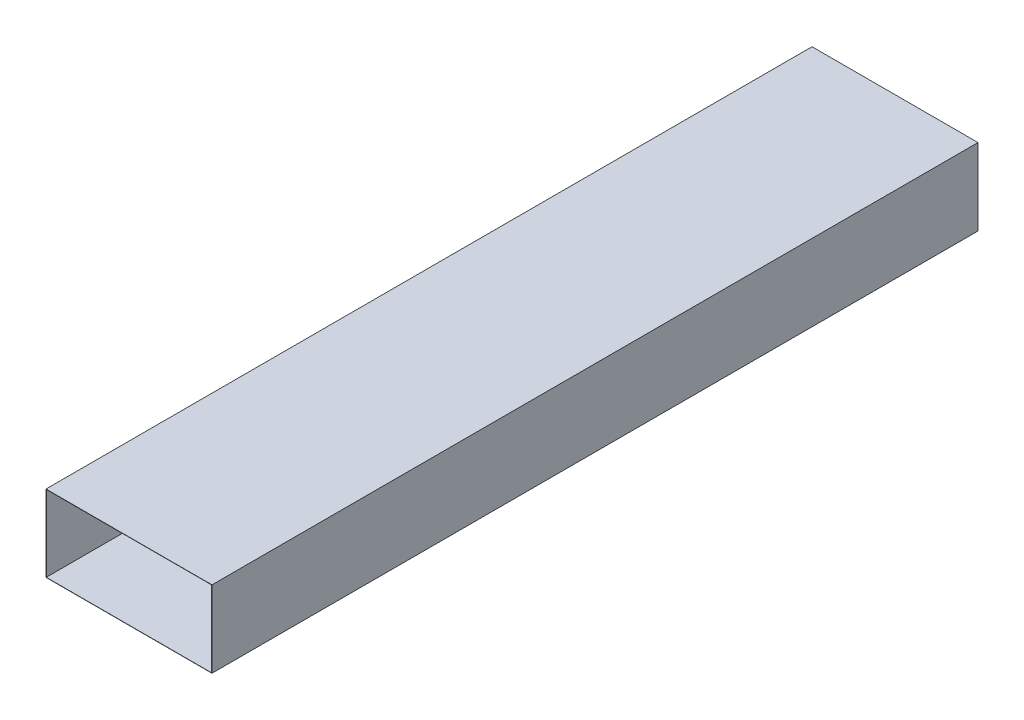
ISO-10303-21;
HEADER;
FILE_DESCRIPTION(('STEP AP214'),'2;1');
FILE_NAME('part.step','',(''),(''),'','','');
FILE_SCHEMA(('AUTOMOTIVE_DESIGN { 1 0 10303 214 1 1 1 1 }'));
ENDSEC;
DATA;
#1=APPLICATION_CONTEXT('core data for automotive mechanical design processes');
#2=APPLICATION_PROTOCOL_DEFINITION('international standard','automotive_design',2000,#1);
#3=PRODUCT_CONTEXT('',#1,'mechanical');
#4=PRODUCT('Part','Part','',(#3));
#5=PRODUCT_RELATED_PRODUCT_CATEGORY('part','',(#4));
#6=PRODUCT_DEFINITION_FORMATION('','',#4);
#7=PRODUCT_DEFINITION_CONTEXT('part definition',#1,'design');
#8=PRODUCT_DEFINITION('design','',#6,#7);
#9=PRODUCT_DEFINITION_SHAPE('','',#8);
#10=(LENGTH_UNIT() NAMED_UNIT(*) SI_UNIT(.MILLI.,.METRE.));
#11=(NAMED_UNIT(*) PLANE_ANGLE_UNIT() SI_UNIT($,.RADIAN.));
#12=(NAMED_UNIT(*) SI_UNIT($,.STERADIAN.) SOLID_ANGLE_UNIT());
#13=UNCERTAINTY_MEASURE_WITH_UNIT(LENGTH_MEASURE(1.E-05),#10,'distance_accuracy_value','');
#14=(GEOMETRIC_REPRESENTATION_CONTEXT(3) GLOBAL_UNCERTAINTY_ASSIGNED_CONTEXT((#13)) GLOBAL_UNIT_ASSIGNED_CONTEXT((#10,
#11,#12)) REPRESENTATION_CONTEXT('',''));
#15=CARTESIAN_POINT('',(0.,0.,0.));
#16=DIRECTION('',(0.,0.,1.));
#17=DIRECTION('',(1.,0.,0.));
#18=AXIS2_PLACEMENT_3D('',#15,#16,#17);
#19=CARTESIAN_POINT('',(-650.,300.,3000.));
#20=DIRECTION('',(0.,1.,0.));
#21=DIRECTION('',(-1.,0.,0.));
#22=AXIS2_PLACEMENT_3D('',#19,#20,#21);
#23=PLANE('',#22);
#24=DIRECTION('',(1.,0.,0.));
#25=VECTOR('',#24,1.);
#26=CARTESIAN_POINT('',(-650.,300.,0.));
#27=LINE('',#26,#25);
#28=CARTESIAN_POINT('',(-650.,300.,0.));
#29=VERTEX_POINT('',#28);
#30=CARTESIAN_POINT('',(0.,300.,0.));
#31=VERTEX_POINT('',#30);
#32=EDGE_CURVE('E152',#29,#31,#27,.T.);
#33=ORIENTED_EDGE('',*,*,#32,.F.);
#34=DIRECTION('',(0.,0.,-1.));
#35=VECTOR('',#34,1.);
#36=CARTESIAN_POINT('',(-650.,300.,3000.));
#37=LINE('',#36,#35);
#38=CARTESIAN_POINT('',(-650.,300.,3000.));
#39=VERTEX_POINT('',#38);
#40=EDGE_CURVE('E12',#39,#29,#37,.T.);
#41=ORIENTED_EDGE('',*,*,#40,.F.);
#42=DIRECTION('',(1.,0.,0.));
#43=VECTOR('',#42,1.);
#44=CARTESIAN_POINT('',(-650.,300.,3000.));
#45=LINE('',#44,#43);
#46=CARTESIAN_POINT('',(0.,300.,3000.));
#47=VERTEX_POINT('',#46);
#48=EDGE_CURVE('E156',#39,#47,#45,.T.);
#49=ORIENTED_EDGE('',*,*,#48,.T.);
#50=DIRECTION('',(0.,0.,-1.));
#51=VECTOR('',#50,1.);
#52=CARTESIAN_POINT('',(0.,300.,3000.));
#53=LINE('',#52,#51);
#54=EDGE_CURVE('E59',#47,#31,#53,.T.);
#55=ORIENTED_EDGE('',*,*,#54,.T.);
#56=EDGE_LOOP('',(#33,#41,#49,#55));
#57=FACE_BOUND('',#56,.T.);
#58=ADVANCED_FACE('F56',(#57),#23,.T.);
#59=CARTESIAN_POINT('',(-650.,300.,3000.));
#60=DIRECTION('',(1.,0.,0.));
#61=DIRECTION('',(0.,0.,-1.));
#62=AXIS2_PLACEMENT_3D('',#59,#60,#61);
#63=PLANE('',#62);
#64=DIRECTION('',(0.,-1.,0.));
#65=VECTOR('',#64,1.);
#66=CARTESIAN_POINT('',(-650.,300.,0.));
#67=LINE('',#66,#65);
#68=CARTESIAN_POINT('',(-650.,0.,0.));
#69=VERTEX_POINT('',#68);
#70=EDGE_CURVE('E160',#29,#69,#67,.T.);
#71=ORIENTED_EDGE('',*,*,#70,.T.);
#72=DIRECTION('',(0.,0.,-1.));
#73=VECTOR('',#72,1.);
#74=CARTESIAN_POINT('',(-650.,0.,3000.));
#75=LINE('',#74,#73);
#76=CARTESIAN_POINT('',(-650.,0.,3000.));
#77=VERTEX_POINT('',#76);
#78=EDGE_CURVE('E64',#77,#69,#75,.T.);
#79=ORIENTED_EDGE('',*,*,#78,.F.);
#80=DIRECTION('',(0.,-1.,0.));
#81=VECTOR('',#80,1.);
#82=CARTESIAN_POINT('',(-650.,300.,3000.));
#83=LINE('',#82,#81);
#84=EDGE_CURVE('E165',#39,#77,#83,.T.);
#85=ORIENTED_EDGE('',*,*,#84,.F.);
#86=ORIENTED_EDGE('',*,*,#40,.T.);
#87=EDGE_LOOP('',(#71,#79,#85,#86));
#88=FACE_BOUND('',#87,.T.);
#89=ADVANCED_FACE('F192',(#88),#63,.F.);
#90=CARTESIAN_POINT('',(-650.,0.,3000.));
#91=DIRECTION('',(0.,1.,0.));
#92=DIRECTION('',(0.,0.,1.));
#93=AXIS2_PLACEMENT_3D('',#90,#91,#92);
#94=PLANE('',#93);
#95=DIRECTION('',(1.,0.,0.));
#96=VECTOR('',#95,1.);
#97=CARTESIAN_POINT('',(-650.,0.,0.));
#98=LINE('',#97,#96);
#99=CARTESIAN_POINT('',(0.,0.,0.));
#100=VERTEX_POINT('',#99);
#101=EDGE_CURVE('E172',#69,#100,#98,.T.);
#102=ORIENTED_EDGE('',*,*,#101,.T.);
#103=DIRECTION('',(0.,0.,-1.));
#104=VECTOR('',#103,1.);
#105=CARTESIAN_POINT('',(0.,0.,3000.));
#106=LINE('',#105,#104);
#107=CARTESIAN_POINT('',(0.,0.,3000.));
#108=VERTEX_POINT('',#107);
#109=EDGE_CURVE('E177',#108,#100,#106,.T.);
#110=ORIENTED_EDGE('',*,*,#109,.F.);
#111=DIRECTION('',(1.,0.,0.));
#112=VECTOR('',#111,1.);
#113=CARTESIAN_POINT('',(-650.,0.,3000.));
#114=LINE('',#113,#112);
#115=EDGE_CURVE('E163',#77,#108,#114,.T.);
#116=ORIENTED_EDGE('',*,*,#115,.F.);
#117=ORIENTED_EDGE('',*,*,#78,.T.);
#118=EDGE_LOOP('',(#102,#110,#116,#117));
#119=FACE_BOUND('',#118,.T.);
#120=ADVANCED_FACE('F196',(#119),#94,.F.);
#121=CARTESIAN_POINT('',(0.,300.,3000.));
#122=DIRECTION('',(1.,0.,0.));
#123=DIRECTION('',(0.,1.,0.));
#124=AXIS2_PLACEMENT_3D('',#121,#122,#123);
#125=PLANE('',#124);
#126=DIRECTION('',(0.,-1.,0.));
#127=VECTOR('',#126,1.);
#128=CARTESIAN_POINT('',(0.,300.,0.));
#129=LINE('',#128,#127);
#130=EDGE_CURVE('E169',#31,#100,#129,.T.);
#131=ORIENTED_EDGE('',*,*,#130,.F.);
#132=ORIENTED_EDGE('',*,*,#54,.F.);
#133=DIRECTION('',(0.,-1.,0.));
#134=VECTOR('',#133,1.);
#135=CARTESIAN_POINT('',(0.,300.,3000.));
#136=LINE('',#135,#134);
#137=EDGE_CURVE('E159',#47,#108,#136,.T.);
#138=ORIENTED_EDGE('',*,*,#137,.T.);
#139=ORIENTED_EDGE('',*,*,#109,.T.);
#140=EDGE_LOOP('',(#131,#132,#138,#139));
#141=FACE_BOUND('',#140,.T.);
#142=ADVANCED_FACE('F185',(#141),#125,.T.);
#143=CARTESIAN_POINT('',(0.,0.,3000.));
#144=DIRECTION('',(0.,0.,-1.));
#145=DIRECTION('',(-1.,0.,0.));
#146=AXIS2_PLACEMENT_3D('',#143,#144,#145);
#147=PLANE('',#146);
#148=DIRECTION('',(0.,-1.,0.));
#149=VECTOR('',#148,1.);
#150=CARTESIAN_POINT('',(-649.,0.,3000.));
#151=LINE('',#150,#149);
#152=CARTESIAN_POINT('',(-649.,299.,3000.));
#153=VERTEX_POINT('',#152);
#154=CARTESIAN_POINT('',(-649.,1.,3000.));
#155=VERTEX_POINT('',#154);
#156=EDGE_CURVE('E126',#153,#155,#151,.T.);
#157=ORIENTED_EDGE('',*,*,#156,.F.);
#158=DIRECTION('',(1.,0.,0.));
#159=VECTOR('',#158,1.);
#160=CARTESIAN_POINT('',(0.,299.,3000.));
#161=LINE('',#160,#159);
#162=CARTESIAN_POINT('',(-1.00000000000003,299.,3000.));
#163=VERTEX_POINT('',#162);
#164=EDGE_CURVE('E123',#153,#163,#161,.T.);
#165=ORIENTED_EDGE('',*,*,#164,.T.);
#166=DIRECTION('',(0.,-1.,0.));
#167=VECTOR('',#166,1.);
#168=CARTESIAN_POINT('',(-1.,0.,3000.));
#169=LINE('',#168,#167);
#170=CARTESIAN_POINT('',(-1.,1.,3000.));
#171=VERTEX_POINT('',#170);
#172=EDGE_CURVE('E129',#163,#171,#169,.T.);
#173=ORIENTED_EDGE('',*,*,#172,.T.);
#174=DIRECTION('',(1.,0.,0.));
#175=VECTOR('',#174,1.);
#176=CARTESIAN_POINT('',(0.,1.,3000.));
#177=LINE('',#176,#175);
#178=EDGE_CURVE('E133',#155,#171,#177,.T.);
#179=ORIENTED_EDGE('',*,*,#178,.F.);
#180=EDGE_LOOP('',(#157,#165,#173,#179));
#181=FACE_BOUND('',#180,.T.);
#182=ORIENTED_EDGE('',*,*,#48,.F.);
#183=ORIENTED_EDGE('',*,*,#84,.T.);
#184=ORIENTED_EDGE('',*,*,#115,.T.);
#185=ORIENTED_EDGE('',*,*,#137,.F.);
#186=EDGE_LOOP('',(#182,#183,#184,#185));
#187=FACE_BOUND('',#186,.T.);
#188=ADVANCED_FACE('F135',(#181,#187),#147,.F.);
#189=CARTESIAN_POINT('',(0.,0.,0.));
#190=DIRECTION('',(0.,0.,-1.));
#191=DIRECTION('',(-1.,0.,0.));
#192=AXIS2_PLACEMENT_3D('',#189,#190,#191);
#193=PLANE('',#192);
#194=DIRECTION('',(1.,0.,0.));
#195=VECTOR('',#194,1.);
#196=CARTESIAN_POINT('',(0.,299.,0.));
#197=LINE('',#196,#195);
#198=CARTESIAN_POINT('',(-649.,299.,0.));
#199=VERTEX_POINT('',#198);
#200=CARTESIAN_POINT('',(-1.00000000000003,299.,0.));
#201=VERTEX_POINT('',#200);
#202=EDGE_CURVE('E80',#199,#201,#197,.T.);
#203=ORIENTED_EDGE('',*,*,#202,.F.);
#204=DIRECTION('',(0.,-1.,0.));
#205=VECTOR('',#204,1.);
#206=CARTESIAN_POINT('',(-649.,0.,0.));
#207=LINE('',#206,#205);
#208=CARTESIAN_POINT('',(-649.,1.,0.));
#209=VERTEX_POINT('',#208);
#210=EDGE_CURVE('E137',#199,#209,#207,.T.);
#211=ORIENTED_EDGE('',*,*,#210,.T.);
#212=DIRECTION('',(1.,0.,0.));
#213=VECTOR('',#212,1.);
#214=CARTESIAN_POINT('',(0.,1.,0.));
#215=LINE('',#214,#213);
#216=CARTESIAN_POINT('',(-1.,1.,0.));
#217=VERTEX_POINT('',#216);
#218=EDGE_CURVE('E140',#209,#217,#215,.T.);
#219=ORIENTED_EDGE('',*,*,#218,.T.);
#220=DIRECTION('',(0.,-1.,0.));
#221=VECTOR('',#220,1.);
#222=CARTESIAN_POINT('',(-1.,0.,0.));
#223=LINE('',#222,#221);
#224=EDGE_CURVE('E146',#201,#217,#223,.T.);
#225=ORIENTED_EDGE('',*,*,#224,.F.);
#226=EDGE_LOOP('',(#203,#211,#219,#225));
#227=FACE_BOUND('',#226,.T.);
#228=ORIENTED_EDGE('',*,*,#32,.T.);
#229=ORIENTED_EDGE('',*,*,#130,.T.);
#230=ORIENTED_EDGE('',*,*,#101,.F.);
#231=ORIENTED_EDGE('',*,*,#70,.F.);
#232=EDGE_LOOP('',(#228,#229,#230,#231));
#233=FACE_BOUND('',#232,.T.);
#234=ADVANCED_FACE('F189',(#227,#233),#193,.T.);
#235=CARTESIAN_POINT('',(0.,299.,3000.));
#236=DIRECTION('',(0.,1.,0.));
#237=DIRECTION('',(-1.,0.,0.));
#238=AXIS2_PLACEMENT_3D('',#235,#236,#237);
#239=PLANE('',#238);
#240=ORIENTED_EDGE('',*,*,#202,.T.);
#241=DIRECTION('',(0.,0.,-1.));
#242=VECTOR('',#241,1.);
#243=CARTESIAN_POINT('',(-1.00000000000003,299.,3000.));
#244=LINE('',#243,#242);
#245=EDGE_CURVE('E120',#163,#201,#244,.T.);
#246=ORIENTED_EDGE('',*,*,#245,.F.);
#247=ORIENTED_EDGE('',*,*,#164,.F.);
#248=DIRECTION('',(0.,0.,-1.));
#249=VECTOR('',#248,1.);
#250=CARTESIAN_POINT('',(-649.,299.,3000.));
#251=LINE('',#250,#249);
#252=EDGE_CURVE('E150',#153,#199,#251,.T.);
#253=ORIENTED_EDGE('',*,*,#252,.T.);
#254=EDGE_LOOP('',(#240,#246,#247,#253));
#255=FACE_BOUND('',#254,.T.);
#256=ADVANCED_FACE('F121',(#255),#239,.F.);
#257=CARTESIAN_POINT('',(-649.,0.,3000.));
#258=DIRECTION('',(1.,0.,0.));
#259=DIRECTION('',(0.,0.,-1.));
#260=AXIS2_PLACEMENT_3D('',#257,#258,#259);
#261=PLANE('',#260);
#262=ORIENTED_EDGE('',*,*,#210,.F.);
#263=ORIENTED_EDGE('',*,*,#252,.F.);
#264=ORIENTED_EDGE('',*,*,#156,.T.);
#265=DIRECTION('',(0.,0.,-1.));
#266=VECTOR('',#265,1.);
#267=CARTESIAN_POINT('',(-649.,1.,3000.));
#268=LINE('',#267,#266);
#269=EDGE_CURVE('E153',#155,#209,#268,.T.);
#270=ORIENTED_EDGE('',*,*,#269,.T.);
#271=EDGE_LOOP('',(#262,#263,#264,#270));
#272=FACE_BOUND('',#271,.T.);
#273=ADVANCED_FACE('F240',(#272),#261,.T.);
#274=CARTESIAN_POINT('',(0.,1.,3000.));
#275=DIRECTION('',(0.,1.,0.));
#276=DIRECTION('',(0.,0.,1.));
#277=AXIS2_PLACEMENT_3D('',#274,#275,#276);
#278=PLANE('',#277);
#279=ORIENTED_EDGE('',*,*,#218,.F.);
#280=ORIENTED_EDGE('',*,*,#269,.F.);
#281=ORIENTED_EDGE('',*,*,#178,.T.);
#282=DIRECTION('',(0.,0.,-1.));
#283=VECTOR('',#282,1.);
#284=CARTESIAN_POINT('',(-1.,1.,3000.));
#285=LINE('',#284,#283);
#286=EDGE_CURVE('E72',#171,#217,#285,.T.);
#287=ORIENTED_EDGE('',*,*,#286,.T.);
#288=EDGE_LOOP('',(#279,#280,#281,#287));
#289=FACE_BOUND('',#288,.T.);
#290=ADVANCED_FACE('F248',(#289),#278,.T.);
#291=CARTESIAN_POINT('',(-1.,0.,3000.));
#292=DIRECTION('',(1.,0.,0.));
#293=DIRECTION('',(0.,1.,0.));
#294=AXIS2_PLACEMENT_3D('',#291,#292,#293);
#295=PLANE('',#294);
#296=ORIENTED_EDGE('',*,*,#224,.T.);
#297=ORIENTED_EDGE('',*,*,#286,.F.);
#298=ORIENTED_EDGE('',*,*,#172,.F.);
#299=ORIENTED_EDGE('',*,*,#245,.T.);
#300=EDGE_LOOP('',(#296,#297,#298,#299));
#301=FACE_BOUND('',#300,.T.);
#302=ADVANCED_FACE('F130',(#301),#295,.F.);
#303=CLOSED_SHELL('',(#58,#89,#120,#142,#188,#234,#256,#273,#290,#302));
#304=MANIFOLD_SOLID_BREP('B2',#303);
#305=ADVANCED_BREP_SHAPE_REPRESENTATION('',(#18,#304),#14);
#306=SHAPE_DEFINITION_REPRESENTATION(#9,#305);
ENDSEC;
END-ISO-10303-21;
